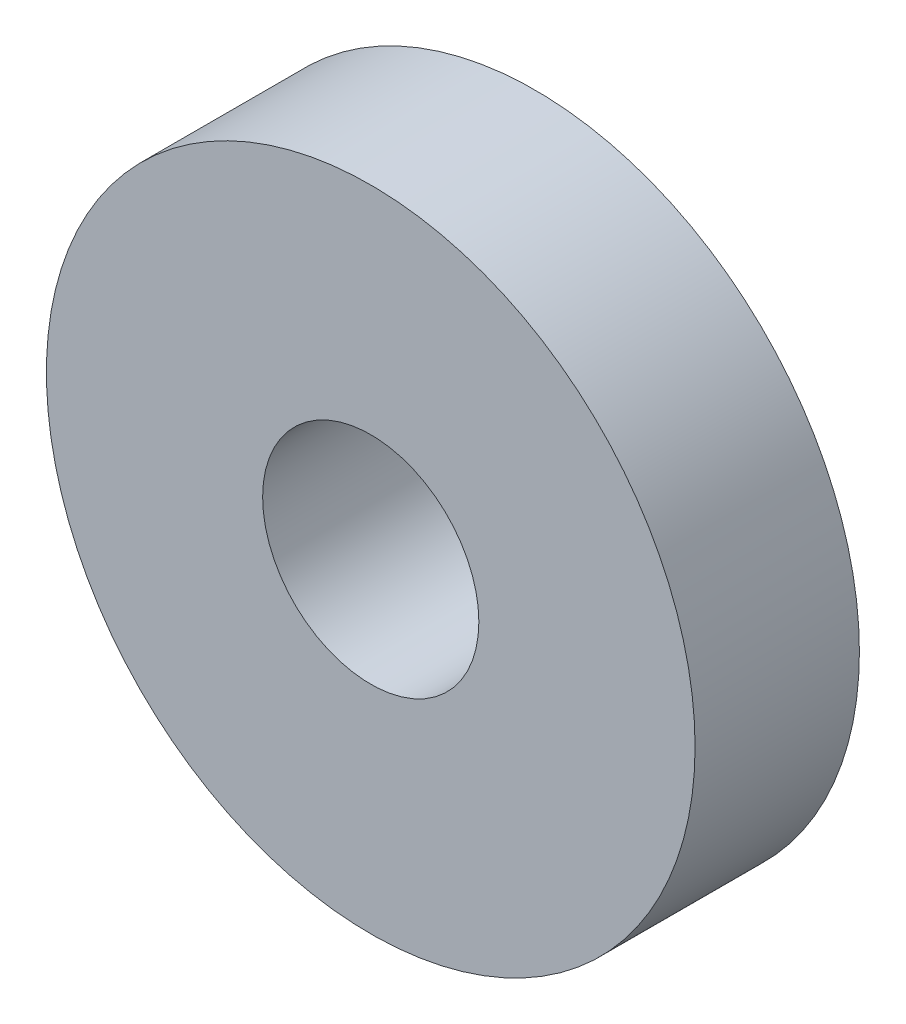
ISO-10303-21;
HEADER;
FILE_DESCRIPTION(('STEP AP214'),'2;1');
FILE_NAME('part.step','',(''),(''),'','','');
FILE_SCHEMA(('AUTOMOTIVE_DESIGN { 1 0 10303 214 1 1 1 1 }'));
ENDSEC;
DATA;
#1=APPLICATION_CONTEXT('core data for automotive mechanical design processes');
#2=APPLICATION_PROTOCOL_DEFINITION('international standard','automotive_design',2000,#1);
#3=PRODUCT_CONTEXT('',#1,'mechanical');
#4=PRODUCT('Part','Part','',(#3));
#5=PRODUCT_RELATED_PRODUCT_CATEGORY('part','',(#4));
#6=PRODUCT_DEFINITION_FORMATION('','',#4);
#7=PRODUCT_DEFINITION_CONTEXT('part definition',#1,'design');
#8=PRODUCT_DEFINITION('design','',#6,#7);
#9=PRODUCT_DEFINITION_SHAPE('','',#8);
#10=(LENGTH_UNIT() NAMED_UNIT(*) SI_UNIT(.MILLI.,.METRE.));
#11=(NAMED_UNIT(*) PLANE_ANGLE_UNIT() SI_UNIT($,.RADIAN.));
#12=(NAMED_UNIT(*) SI_UNIT($,.STERADIAN.) SOLID_ANGLE_UNIT());
#13=UNCERTAINTY_MEASURE_WITH_UNIT(LENGTH_MEASURE(1.E-05),#10,'distance_accuracy_value','');
#14=(GEOMETRIC_REPRESENTATION_CONTEXT(3) GLOBAL_UNCERTAINTY_ASSIGNED_CONTEXT((#13)) GLOBAL_UNIT_ASSIGNED_CONTEXT((#10,
#11,#12)) REPRESENTATION_CONTEXT('',''));
#15=CARTESIAN_POINT('',(0.,0.,0.));
#16=DIRECTION('',(0.,0.,1.));
#17=DIRECTION('',(1.,0.,0.));
#18=AXIS2_PLACEMENT_3D('',#15,#16,#17);
#19=CARTESIAN_POINT('',(0.,0.,-25.1132034355964));
#20=DIRECTION('',(0.,0.,1.));
#21=DIRECTION('',(1.,0.,0.));
#22=AXIS2_PLACEMENT_3D('',#19,#20,#21);
#23=CYLINDRICAL_SURFACE('',#22,7.5);
#24=CARTESIAN_POINT('',(0.,0.,0.));
#25=DIRECTION('',(0.,0.,1.));
#26=DIRECTION('',(1.,0.,0.));
#27=AXIS2_PLACEMENT_3D('',#24,#25,#26);
#28=CIRCLE('',#27,7.5);
#29=CARTESIAN_POINT('',(7.5,0.,0.));
#30=VERTEX_POINT('',#29);
#31=EDGE_CURVE('E38',#30,#30,#28,.T.);
#32=ORIENTED_EDGE('',*,*,#31,.F.);
#33=EDGE_LOOP('',(#32));
#34=FACE_BOUND('',#33,.T.);
#35=CARTESIAN_POINT('',(0.,0.,-3.8));
#36=DIRECTION('',(0.,0.,-1.));
#37=DIRECTION('',(-1.,0.,0.));
#38=AXIS2_PLACEMENT_3D('',#35,#36,#37);
#39=CIRCLE('',#38,7.5);
#40=CARTESIAN_POINT('',(-7.5,0.,-3.8));
#41=VERTEX_POINT('',#40);
#42=EDGE_CURVE('E34',#41,#41,#39,.F.);
#43=ORIENTED_EDGE('',*,*,#42,.T.);
#44=EDGE_LOOP('',(#43));
#45=FACE_BOUND('',#44,.T.);
#46=ADVANCED_FACE('F30',(#34,#45),#23,.T.);
#47=CARTESIAN_POINT('',(0.,0.,-25.1132034355964));
#48=DIRECTION('',(0.,0.,1.));
#49=DIRECTION('',(1.,0.,0.));
#50=AXIS2_PLACEMENT_3D('',#47,#48,#49);
#51=CYLINDRICAL_SURFACE('',#50,2.5001);
#52=CARTESIAN_POINT('',(0.,0.,0.));
#53=DIRECTION('',(0.,0.,1.));
#54=DIRECTION('',(1.,0.,0.));
#55=AXIS2_PLACEMENT_3D('',#52,#53,#54);
#56=CIRCLE('',#55,2.5001);
#57=CARTESIAN_POINT('',(2.5001,0.,0.));
#58=VERTEX_POINT('',#57);
#59=EDGE_CURVE('E42',#58,#58,#56,.T.);
#60=ORIENTED_EDGE('',*,*,#59,.T.);
#61=EDGE_LOOP('',(#60));
#62=FACE_BOUND('',#61,.T.);
#63=CARTESIAN_POINT('',(0.,0.,-3.8));
#64=DIRECTION('',(0.,0.,-1.));
#65=DIRECTION('',(-1.,0.,0.));
#66=AXIS2_PLACEMENT_3D('',#63,#64,#65);
#67=CIRCLE('',#66,2.5001);
#68=CARTESIAN_POINT('',(-2.5001,0.,-3.8));
#69=VERTEX_POINT('',#68);
#70=EDGE_CURVE('E11',#69,#69,#67,.F.);
#71=ORIENTED_EDGE('',*,*,#70,.F.);
#72=EDGE_LOOP('',(#71));
#73=FACE_BOUND('',#72,.T.);
#74=ADVANCED_FACE('F57',(#62,#73),#51,.F.);
#75=CARTESIAN_POINT('',(0.,0.,0.));
#76=DIRECTION('',(0.,0.,1.));
#77=DIRECTION('',(1.,0.,0.));
#78=AXIS2_PLACEMENT_3D('',#75,#76,#77);
#79=PLANE('',#78);
#80=ORIENTED_EDGE('',*,*,#59,.F.);
#81=EDGE_LOOP('',(#80));
#82=FACE_BOUND('',#81,.T.);
#83=ORIENTED_EDGE('',*,*,#31,.T.);
#84=EDGE_LOOP('',(#83));
#85=FACE_BOUND('',#84,.T.);
#86=ADVANCED_FACE('F53',(#82,#85),#79,.T.);
#87=CARTESIAN_POINT('',(17.2319032971318,19.3495426899277,-3.8));
#88=DIRECTION('',(0.,0.,-1.));
#89=DIRECTION('',(-1.,0.,0.));
#90=AXIS2_PLACEMENT_3D('',#87,#88,#89);
#91=PLANE('',#90);
#92=ORIENTED_EDGE('',*,*,#42,.F.);
#93=EDGE_LOOP('',(#92));
#94=FACE_BOUND('',#93,.T.);
#95=ORIENTED_EDGE('',*,*,#70,.T.);
#96=EDGE_LOOP('',(#95));
#97=FACE_BOUND('',#96,.T.);
#98=ADVANCED_FACE('F32',(#94,#97),#91,.T.);
#99=CLOSED_SHELL('',(#46,#74,#86,#98));
#100=MANIFOLD_SOLID_BREP('B2',#99);
#101=ADVANCED_BREP_SHAPE_REPRESENTATION('',(#18,#100),#14);
#102=SHAPE_DEFINITION_REPRESENTATION(#9,#101);
ENDSEC;
END-ISO-10303-21;
